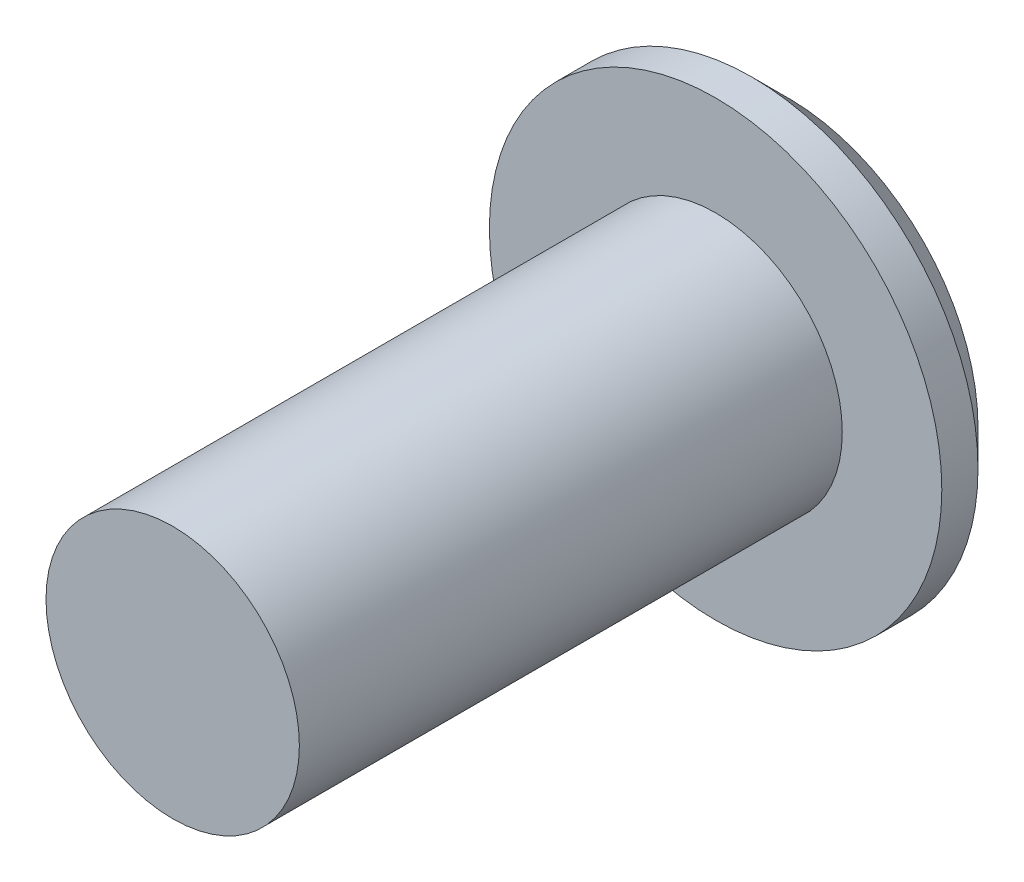
ISO-10303-21;
HEADER;
FILE_DESCRIPTION(('STEP AP214'),'2;1');
FILE_NAME('part.step','',(''),(''),'','','');
FILE_SCHEMA(('AUTOMOTIVE_DESIGN { 1 0 10303 214 1 1 1 1 }'));
ENDSEC;
DATA;
#1=APPLICATION_CONTEXT('core data for automotive mechanical design processes');
#2=APPLICATION_PROTOCOL_DEFINITION('international standard','automotive_design',2000,#1);
#3=PRODUCT_CONTEXT('',#1,'mechanical');
#4=PRODUCT('Part','Part','',(#3));
#5=PRODUCT_RELATED_PRODUCT_CATEGORY('part','',(#4));
#6=PRODUCT_DEFINITION_FORMATION('','',#4);
#7=PRODUCT_DEFINITION_CONTEXT('part definition',#1,'design');
#8=PRODUCT_DEFINITION('design','',#6,#7);
#9=PRODUCT_DEFINITION_SHAPE('','',#8);
#10=(LENGTH_UNIT() NAMED_UNIT(*) SI_UNIT(.MILLI.,.METRE.));
#11=(NAMED_UNIT(*) PLANE_ANGLE_UNIT() SI_UNIT($,.RADIAN.));
#12=(NAMED_UNIT(*) SI_UNIT($,.STERADIAN.) SOLID_ANGLE_UNIT());
#13=UNCERTAINTY_MEASURE_WITH_UNIT(LENGTH_MEASURE(1.E-05),#10,'distance_accuracy_value','');
#14=(GEOMETRIC_REPRESENTATION_CONTEXT(3) GLOBAL_UNCERTAINTY_ASSIGNED_CONTEXT((#13)) GLOBAL_UNIT_ASSIGNED_CONTEXT((#10,
#11,#12)) REPRESENTATION_CONTEXT('',''));
#15=CARTESIAN_POINT('',(0.,0.,0.));
#16=DIRECTION('',(0.,0.,1.));
#17=DIRECTION('',(1.,0.,0.));
#18=AXIS2_PLACEMENT_3D('',#15,#16,#17);
#19=CARTESIAN_POINT('',(0.,0.,4.));
#20=DIRECTION('',(0.,0.,-1.));
#21=DIRECTION('',(-1.,0.,0.));
#22=AXIS2_PLACEMENT_3D('',#19,#20,#21);
#23=CYLINDRICAL_SURFACE('',#22,12.5);
#24=CARTESIAN_POINT('',(0.,0.,2.));
#25=DIRECTION('',(0.,0.,1.));
#26=DIRECTION('',(1.,0.,0.));
#27=AXIS2_PLACEMENT_3D('',#24,#25,#26);
#28=CIRCLE('',#27,12.5);
#29=CARTESIAN_POINT('',(12.5,0.,2.));
#30=VERTEX_POINT('',#29);
#31=EDGE_CURVE('E48',#30,#30,#28,.T.);
#32=ORIENTED_EDGE('',*,*,#31,.T.);
#33=EDGE_LOOP('',(#32));
#34=FACE_BOUND('',#33,.T.);
#35=CARTESIAN_POINT('',(0.,0.,4.));
#36=DIRECTION('',(0.,0.,1.));
#37=DIRECTION('',(1.,0.,0.));
#38=AXIS2_PLACEMENT_3D('',#35,#36,#37);
#39=CIRCLE('',#38,12.5);
#40=CARTESIAN_POINT('',(12.5,0.,4.));
#41=VERTEX_POINT('',#40);
#42=EDGE_CURVE('E58',#41,#41,#39,.T.);
#43=ORIENTED_EDGE('',*,*,#42,.F.);
#44=EDGE_LOOP('',(#43));
#45=FACE_BOUND('',#44,.T.);
#46=ADVANCED_FACE('F39',(#34,#45),#23,.T.);
#47=CARTESIAN_POINT('',(0.,0.,4.));
#48=DIRECTION('',(0.,0.,1.));
#49=DIRECTION('',(1.,0.,0.));
#50=AXIS2_PLACEMENT_3D('',#47,#48,#49);
#51=PLANE('',#50);
#52=CARTESIAN_POINT('',(0.,0.,4.));
#53=DIRECTION('',(0.,0.,1.));
#54=DIRECTION('',(1.,0.,0.));
#55=AXIS2_PLACEMENT_3D('',#52,#53,#54);
#56=CIRCLE('',#55,7.);
#57=CARTESIAN_POINT('',(7.,0.,4.));
#58=VERTEX_POINT('',#57);
#59=EDGE_CURVE('E53',#58,#58,#56,.T.);
#60=ORIENTED_EDGE('',*,*,#59,.F.);
#61=EDGE_LOOP('',(#60));
#62=FACE_BOUND('',#61,.T.);
#63=ORIENTED_EDGE('',*,*,#42,.T.);
#64=EDGE_LOOP('',(#63));
#65=FACE_BOUND('',#64,.T.);
#66=ADVANCED_FACE('F78',(#62,#65),#51,.T.);
#67=CARTESIAN_POINT('',(0.,0.,0.));
#68=DIRECTION('',(0.,0.,1.));
#69=DIRECTION('',(1.,0.,0.));
#70=AXIS2_PLACEMENT_3D('',#67,#68,#69);
#71=PLANE('',#70);
#72=CARTESIAN_POINT('',(0.,0.,0.));
#73=DIRECTION('',(0.,0.,1.));
#74=DIRECTION('',(1.,0.,0.));
#75=AXIS2_PLACEMENT_3D('',#72,#73,#74);
#76=CIRCLE('',#75,10.5);
#77=CARTESIAN_POINT('',(10.5,0.,0.));
#78=VERTEX_POINT('',#77);
#79=EDGE_CURVE('E10',#78,#78,#76,.F.);
#80=ORIENTED_EDGE('',*,*,#79,.T.);
#81=EDGE_LOOP('',(#80));
#82=FACE_BOUND('',#81,.T.);
#83=ADVANCED_FACE('F74',(#82),#71,.F.);
#84=CARTESIAN_POINT('',(0.,0.,34.));
#85=DIRECTION('',(0.,0.,-1.));
#86=DIRECTION('',(-1.,0.,0.));
#87=AXIS2_PLACEMENT_3D('',#84,#85,#86);
#88=CYLINDRICAL_SURFACE('',#87,7.);
#89=CARTESIAN_POINT('',(0.,0.,34.));
#90=DIRECTION('',(0.,0.,1.));
#91=DIRECTION('',(1.,0.,0.));
#92=AXIS2_PLACEMENT_3D('',#89,#90,#91);
#93=CIRCLE('',#92,7.);
#94=CARTESIAN_POINT('',(7.,0.,34.));
#95=VERTEX_POINT('',#94);
#96=EDGE_CURVE('E63',#95,#95,#93,.T.);
#97=ORIENTED_EDGE('',*,*,#96,.F.);
#98=EDGE_LOOP('',(#97));
#99=FACE_BOUND('',#98,.T.);
#100=ORIENTED_EDGE('',*,*,#59,.T.);
#101=EDGE_LOOP('',(#100));
#102=FACE_BOUND('',#101,.T.);
#103=ADVANCED_FACE('F71',(#99,#102),#88,.T.);
#104=CARTESIAN_POINT('',(0.,0.,34.));
#105=DIRECTION('',(0.,0.,1.));
#106=DIRECTION('',(1.,0.,0.));
#107=AXIS2_PLACEMENT_3D('',#104,#105,#106);
#108=PLANE('',#107);
#109=ORIENTED_EDGE('',*,*,#96,.T.);
#110=EDGE_LOOP('',(#109));
#111=FACE_BOUND('',#110,.T.);
#112=ADVANCED_FACE('F69',(#111),#108,.T.);
#113=CARTESIAN_POINT('',(0.,0.,2.));
#114=DIRECTION('',(0.,0.,1.));
#115=DIRECTION('',(1.,0.,0.));
#116=AXIS2_PLACEMENT_3D('',#113,#114,#115);
#117=CONICAL_SURFACE('',#116,12.5,0.78539816339745);
#118=ORIENTED_EDGE('',*,*,#79,.F.);
#119=EDGE_LOOP('',(#118));
#120=FACE_BOUND('',#119,.T.);
#121=ORIENTED_EDGE('',*,*,#31,.F.);
#122=EDGE_LOOP('',(#121));
#123=FACE_BOUND('',#122,.T.);
#124=ADVANCED_FACE('F42',(#120,#123),#117,.T.);
#125=CLOSED_SHELL('',(#46,#66,#83,#103,#112,#124));
#126=MANIFOLD_SOLID_BREP('B2',#125);
#127=ADVANCED_BREP_SHAPE_REPRESENTATION('',(#18,#126),#14);
#128=SHAPE_DEFINITION_REPRESENTATION(#9,#127);
ENDSEC;
END-ISO-10303-21;
